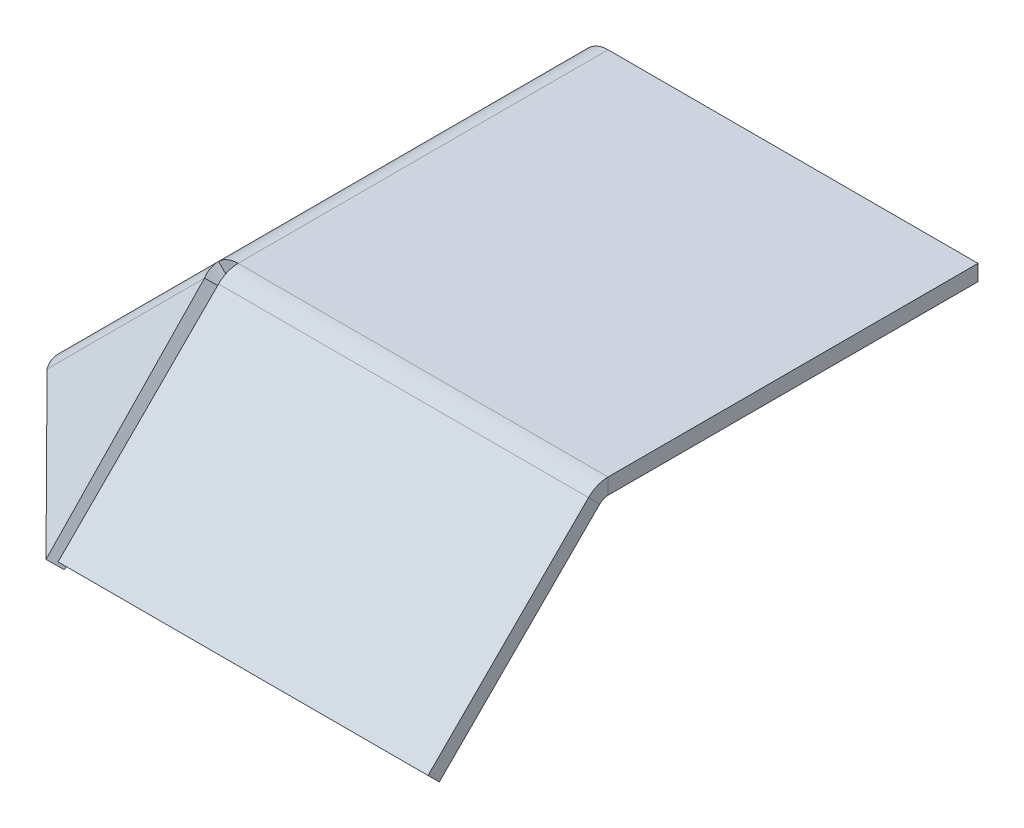
ISO-10303-21;
HEADER;
FILE_DESCRIPTION(('STEP AP214'),'2;1');
FILE_NAME('part.step','',(''),(''),'','','');
FILE_SCHEMA(('AUTOMOTIVE_DESIGN { 1 0 10303 214 1 1 1 1 }'));
ENDSEC;
DATA;
#1=APPLICATION_CONTEXT('core data for automotive mechanical design processes');
#2=APPLICATION_PROTOCOL_DEFINITION('international standard','automotive_design',2000,#1);
#3=PRODUCT_CONTEXT('',#1,'mechanical');
#4=PRODUCT('Part','Part','',(#3));
#5=PRODUCT_RELATED_PRODUCT_CATEGORY('part','',(#4));
#6=PRODUCT_DEFINITION_FORMATION('','',#4);
#7=PRODUCT_DEFINITION_CONTEXT('part definition',#1,'design');
#8=PRODUCT_DEFINITION('design','',#6,#7);
#9=PRODUCT_DEFINITION_SHAPE('','',#8);
#10=(LENGTH_UNIT() NAMED_UNIT(*) SI_UNIT(.MILLI.,.METRE.));
#11=(NAMED_UNIT(*) PLANE_ANGLE_UNIT() SI_UNIT($,.RADIAN.));
#12=(NAMED_UNIT(*) SI_UNIT($,.STERADIAN.) SOLID_ANGLE_UNIT());
#13=UNCERTAINTY_MEASURE_WITH_UNIT(LENGTH_MEASURE(1.E-05),#10,'distance_accuracy_value','');
#14=(GEOMETRIC_REPRESENTATION_CONTEXT(3) GLOBAL_UNCERTAINTY_ASSIGNED_CONTEXT((#13)) GLOBAL_UNIT_ASSIGNED_CONTEXT((#10,
#11,#12)) REPRESENTATION_CONTEXT('',''));
#15=CARTESIAN_POINT('',(0.,0.,0.));
#16=DIRECTION('',(0.,0.,1.));
#17=DIRECTION('',(1.,0.,0.));
#18=AXIS2_PLACEMENT_3D('',#15,#16,#17);
#19=CARTESIAN_POINT('',(0.,-1.,0.));
#20=DIRECTION('',(0.,1.,0.));
#21=DIRECTION('',(0.,0.,1.));
#22=AXIS2_PLACEMENT_3D('',#19,#20,#21);
#23=PLANE('',#22);
#24=DIRECTION('',(-1.,0.,0.));
#25=VECTOR('',#24,1.);
#26=CARTESIAN_POINT('',(-10.7806767275829,-0.999999999999998,10.7806767275829));
#27=LINE('',#26,#25);
#28=CARTESIAN_POINT('',(-10.7806767275829,-0.999999999999998,10.7806767275829));
#29=VERTEX_POINT('',#28);
#30=CARTESIAN_POINT('',(12.5,-0.999999999999998,10.7806767275829));
#31=VERTEX_POINT('',#30);
#32=EDGE_CURVE('E398',#29,#31,#27,.F.);
#33=ORIENTED_EDGE('',*,*,#32,.F.);
#34=DIRECTION('',(0.,0.,-1.));
#35=VECTOR('',#34,1.);
#36=CARTESIAN_POINT('',(-10.7806767275829,-0.999999999999989,-12.5));
#37=LINE('',#36,#35);
#38=CARTESIAN_POINT('',(-10.7806767275829,-0.999999999999989,-12.5));
#39=VERTEX_POINT('',#38);
#40=EDGE_CURVE('E400',#39,#29,#37,.F.);
#41=ORIENTED_EDGE('',*,*,#40,.F.);
#42=DIRECTION('',(-1.,0.,0.));
#43=VECTOR('',#42,1.);
#44=CARTESIAN_POINT('',(-12.5,-1.,-12.5));
#45=LINE('',#44,#43);
#46=CARTESIAN_POINT('',(12.5,-1.,-12.5));
#47=VERTEX_POINT('',#46);
#48=EDGE_CURVE('E101',#47,#39,#45,.T.);
#49=ORIENTED_EDGE('',*,*,#48,.F.);
#50=DIRECTION('',(0.,0.,-1.));
#51=VECTOR('',#50,1.);
#52=CARTESIAN_POINT('',(12.5,-1.,-12.5));
#53=LINE('',#52,#51);
#54=EDGE_CURVE('E106',#31,#47,#53,.T.);
#55=ORIENTED_EDGE('',*,*,#54,.F.);
#56=EDGE_LOOP('',(#33,#41,#49,#55));
#57=FACE_BOUND('',#56,.T.);
#58=ADVANCED_FACE('F92',(#57),#23,.F.);
#59=CARTESIAN_POINT('',(0.,0.,0.));
#60=DIRECTION('',(0.,1.,0.));
#61=DIRECTION('',(0.,0.,1.));
#62=AXIS2_PLACEMENT_3D('',#59,#60,#61);
#63=PLANE('',#62);
#64=DIRECTION('',(0.,0.,-1.));
#65=VECTOR('',#64,1.);
#66=CARTESIAN_POINT('',(-10.7806767275829,0.,-12.5));
#67=LINE('',#66,#65);
#68=CARTESIAN_POINT('',(-10.7806767275829,0.,-12.5));
#69=VERTEX_POINT('',#68);
#70=CARTESIAN_POINT('',(-10.7806767275829,0.,10.7806767275829));
#71=VERTEX_POINT('',#70);
#72=EDGE_CURVE('E387',#69,#71,#67,.F.);
#73=ORIENTED_EDGE('',*,*,#72,.T.);
#74=DIRECTION('',(-1.,0.,0.));
#75=VECTOR('',#74,1.);
#76=CARTESIAN_POINT('',(-10.7806767275829,0.,10.7806767275829));
#77=LINE('',#76,#75);
#78=CARTESIAN_POINT('',(12.5,0.,10.7806767275829));
#79=VERTEX_POINT('',#78);
#80=EDGE_CURVE('E389',#71,#79,#77,.F.);
#81=ORIENTED_EDGE('',*,*,#80,.T.);
#82=DIRECTION('',(0.,0.,-1.));
#83=VECTOR('',#82,1.);
#84=CARTESIAN_POINT('',(12.5,0.,-12.5));
#85=LINE('',#84,#83);
#86=CARTESIAN_POINT('',(12.5,0.,-12.5));
#87=VERTEX_POINT('',#86);
#88=EDGE_CURVE('E383',#79,#87,#85,.T.);
#89=ORIENTED_EDGE('',*,*,#88,.T.);
#90=DIRECTION('',(-1.,0.,0.));
#91=VECTOR('',#90,1.);
#92=CARTESIAN_POINT('',(-12.5,0.,-12.5));
#93=LINE('',#92,#91);
#94=EDGE_CURVE('E379',#87,#69,#93,.T.);
#95=ORIENTED_EDGE('',*,*,#94,.T.);
#96=EDGE_LOOP('',(#73,#81,#89,#95));
#97=FACE_BOUND('',#96,.T.);
#98=ADVANCED_FACE('F361',(#97),#63,.T.);
#99=CARTESIAN_POINT('',(-12.5,-1.,-12.5));
#100=DIRECTION('',(0.,0.,-1.));
#101=DIRECTION('',(-1.,0.,0.));
#102=AXIS2_PLACEMENT_3D('',#99,#100,#101);
#103=PLANE('',#102);
#104=ORIENTED_EDGE('',*,*,#48,.T.);
#105=DIRECTION('',(0.,1.,0.));
#106=VECTOR('',#105,1.);
#107=CARTESIAN_POINT('',(-10.7806767275829,-0.999999999999989,-12.5));
#108=LINE('',#107,#106);
#109=EDGE_CURVE('E375',#39,#69,#108,.T.);
#110=ORIENTED_EDGE('',*,*,#109,.T.);
#111=ORIENTED_EDGE('',*,*,#94,.F.);
#112=DIRECTION('',(0.,1.,0.));
#113=VECTOR('',#112,1.);
#114=CARTESIAN_POINT('',(12.5,-1.,-12.5));
#115=LINE('',#114,#113);
#116=EDGE_CURVE('E13',#47,#87,#115,.T.);
#117=ORIENTED_EDGE('',*,*,#116,.F.);
#118=EDGE_LOOP('',(#104,#110,#111,#117));
#119=FACE_BOUND('',#118,.T.);
#120=ADVANCED_FACE('F364',(#119),#103,.T.);
#121=CARTESIAN_POINT('',(12.5,-1.,-12.5));
#122=DIRECTION('',(1.,0.,0.));
#123=DIRECTION('',(0.,0.,-1.));
#124=AXIS2_PLACEMENT_3D('',#121,#122,#123);
#125=PLANE('',#124);
#126=DIRECTION('',(0.,1.,0.));
#127=VECTOR('',#126,1.);
#128=CARTESIAN_POINT('',(12.5,-0.999999999999998,10.7806767275829));
#129=LINE('',#128,#127);
#130=EDGE_CURVE('E391',#31,#79,#129,.T.);
#131=ORIENTED_EDGE('',*,*,#130,.F.);
#132=ORIENTED_EDGE('',*,*,#54,.T.);
#133=ORIENTED_EDGE('',*,*,#116,.T.);
#134=ORIENTED_EDGE('',*,*,#88,.F.);
#135=EDGE_LOOP('',(#131,#132,#133,#134));
#136=FACE_BOUND('',#135,.T.);
#137=ADVANCED_FACE('F94',(#136),#125,.T.);
#138=CARTESIAN_POINT('',(-10.7806767275829,-1.7366,10.7806767275829));
#139=DIRECTION('',(0.,0.,1.));
#140=DIRECTION('',(0.,-1.,0.));
#141=AXIS2_PLACEMENT_3D('',#138,#139,#140);
#142=PLANE('',#141);
#143=DIRECTION('',(0.707106781186544,-0.707106781186551,0.));
#144=VECTOR('',#143,1.);
#145=CARTESIAN_POINT('',(-11.3015315826049,-1.21574514497799,10.7806767275829));
#146=LINE('',#145,#144);
#147=CARTESIAN_POINT('',(-12.0086383637914,-0.508638363791433,10.7806767275829));
#148=VERTEX_POINT('',#147);
#149=CARTESIAN_POINT('',(-11.3015315826049,-1.21574514497799,10.7806767275829));
#150=VERTEX_POINT('',#149);
#151=EDGE_CURVE('E411',#148,#150,#146,.T.);
#152=ORIENTED_EDGE('',*,*,#151,.T.);
#153=CARTESIAN_POINT('',(-10.7806767275829,-1.7366,10.7806767275829));
#154=DIRECTION('',(0.,0.,-1.));
#155=DIRECTION('',(0.,1.,0.));
#156=AXIS2_PLACEMENT_3D('',#153,#154,#155);
#157=CIRCLE('',#156,0.736600000000002);
#158=EDGE_CURVE('E448',#29,#150,#157,.F.);
#159=ORIENTED_EDGE('',*,*,#158,.F.);
#160=DIRECTION('',(0.,1.,0.));
#161=VECTOR('',#160,1.);
#162=CARTESIAN_POINT('',(-10.7806767275829,-0.999999999999998,10.7806767275829));
#163=LINE('',#162,#161);
#164=EDGE_CURVE('E384',#29,#71,#163,.T.);
#165=ORIENTED_EDGE('',*,*,#164,.T.);
#166=CARTESIAN_POINT('',(-10.7806767275829,-1.7366,10.7806767275829));
#167=DIRECTION('',(0.,0.,-1.));
#168=DIRECTION('',(0.,1.,0.));
#169=AXIS2_PLACEMENT_3D('',#166,#167,#168);
#170=CIRCLE('',#169,1.7366);
#171=EDGE_CURVE('E442',#71,#148,#170,.F.);
#172=ORIENTED_EDGE('',*,*,#171,.T.);
#173=EDGE_LOOP('',(#152,#159,#165,#172));
#174=FACE_BOUND('',#173,.T.);
#175=ADVANCED_FACE('F352',(#174),#142,.T.);
#176=CARTESIAN_POINT('',(-10.7806767275829,-1.73659999999999,-12.5));
#177=DIRECTION('',(0.,0.,1.));
#178=DIRECTION('',(0.,-1.,0.));
#179=AXIS2_PLACEMENT_3D('',#176,#177,#178);
#180=PLANE('',#179);
#181=CARTESIAN_POINT('',(-10.7806767275829,-1.73659999999999,-12.5));
#182=DIRECTION('',(0.,0.,-1.));
#183=DIRECTION('',(0.,1.,0.));
#184=AXIS2_PLACEMENT_3D('',#181,#182,#183);
#185=CIRCLE('',#184,0.736600000000002);
#186=CARTESIAN_POINT('',(-11.3015315826049,-1.21574514497798,-12.5));
#187=VERTEX_POINT('',#186);
#188=EDGE_CURVE('E414',#187,#39,#185,.T.);
#189=ORIENTED_EDGE('',*,*,#188,.F.);
#190=DIRECTION('',(-0.707106781186544,0.707106781186551,0.));
#191=VECTOR('',#190,1.);
#192=CARTESIAN_POINT('',(-11.3015315826049,-1.21574514497798,-12.5));
#193=LINE('',#192,#191);
#194=CARTESIAN_POINT('',(-12.0086383637914,-0.508638363791431,-12.5));
#195=VERTEX_POINT('',#194);
#196=EDGE_CURVE('E431',#187,#195,#193,.T.);
#197=ORIENTED_EDGE('',*,*,#196,.T.);
#198=CARTESIAN_POINT('',(-10.7806767275829,-1.73659999999999,-12.5));
#199=DIRECTION('',(0.,0.,-1.));
#200=DIRECTION('',(0.,1.,0.));
#201=AXIS2_PLACEMENT_3D('',#198,#199,#200);
#202=CIRCLE('',#201,1.7366);
#203=EDGE_CURVE('E443',#195,#69,#202,.T.);
#204=ORIENTED_EDGE('',*,*,#203,.T.);
#205=ORIENTED_EDGE('',*,*,#109,.F.);
#206=EDGE_LOOP('',(#189,#197,#204,#205));
#207=FACE_BOUND('',#206,.T.);
#208=ADVANCED_FACE('F347',(#207),#180,.F.);
#209=CARTESIAN_POINT('',(-10.7806767275829,-1.73659999999999,-12.5));
#210=DIRECTION('',(0.,0.,-1.));
#211=DIRECTION('',(-0.707106781186544,0.707106781186551,0.));
#212=AXIS2_PLACEMENT_3D('',#209,#210,#211);
#213=CYLINDRICAL_SURFACE('',#212,1.7366);
#214=ORIENTED_EDGE('',*,*,#72,.F.);
#215=ORIENTED_EDGE('',*,*,#203,.F.);
#216=DIRECTION('',(0.,0.,-1.));
#217=VECTOR('',#216,1.);
#218=CARTESIAN_POINT('',(-12.0086383637914,-0.508638363791432,0.));
#219=LINE('',#218,#217);
#220=EDGE_CURVE('E428',#148,#195,#219,.T.);
#221=ORIENTED_EDGE('',*,*,#220,.F.);
#222=ORIENTED_EDGE('',*,*,#171,.F.);
#223=EDGE_LOOP('',(#214,#215,#221,#222));
#224=FACE_BOUND('',#223,.T.);
#225=ADVANCED_FACE('F344',(#224),#213,.T.);
#226=CARTESIAN_POINT('',(-10.7806767275829,-1.73659999999999,-12.5));
#227=DIRECTION('',(0.,0.,-1.));
#228=DIRECTION('',(-0.707106781186544,0.707106781186551,0.));
#229=AXIS2_PLACEMENT_3D('',#226,#227,#228);
#230=CYLINDRICAL_SURFACE('',#229,0.736600000000002);
#231=ORIENTED_EDGE('',*,*,#40,.T.);
#232=ORIENTED_EDGE('',*,*,#158,.T.);
#233=DIRECTION('',(0.,0.,1.));
#234=VECTOR('',#233,1.);
#235=CARTESIAN_POINT('',(-11.3015315826049,-1.21574514497798,12.5));
#236=LINE('',#235,#234);
#237=EDGE_CURVE('E434',#150,#187,#236,.F.);
#238=ORIENTED_EDGE('',*,*,#237,.T.);
#239=ORIENTED_EDGE('',*,*,#188,.T.);
#240=EDGE_LOOP('',(#231,#232,#238,#239));
#241=FACE_BOUND('',#240,.T.);
#242=ADVANCED_FACE('F332',(#241),#230,.F.);
#243=CARTESIAN_POINT('',(-5.04289321881338,6.45710678118655,0.));
#244=DIRECTION('',(-0.707106781186544,0.707106781186551,0.));
#245=DIRECTION('',(-0.707106781186551,-0.707106781186544,0.));
#246=AXIS2_PLACEMENT_3D('',#243,#244,#245);
#247=PLANE('',#246);
#248=DIRECTION('',(0.,0.,-1.));
#249=VECTOR('',#248,1.);
#250=CARTESIAN_POINT('',(-22.1066017177983,-10.6066017177982,-12.5));
#251=LINE('',#250,#249);
#252=CARTESIAN_POINT('',(-22.1066017177982,-10.6066017177982,10.7806767275829));
#253=VERTEX_POINT('',#252);
#254=CARTESIAN_POINT('',(-22.1066017177983,-10.6066017177982,-12.5));
#255=VERTEX_POINT('',#254);
#256=EDGE_CURVE('E421',#253,#255,#251,.T.);
#257=ORIENTED_EDGE('',*,*,#256,.F.);
#258=DIRECTION('',(0.707106781186551,0.707106781186544,0.));
#259=VECTOR('',#258,1.);
#260=CARTESIAN_POINT('',(-5.04289321881338,6.45710678118654,10.7806767275829));
#261=LINE('',#260,#259);
#262=EDGE_CURVE('E202',#253,#148,#261,.T.);
#263=ORIENTED_EDGE('',*,*,#262,.T.);
#264=ORIENTED_EDGE('',*,*,#220,.T.);
#265=DIRECTION('',(0.707106781186551,0.707106781186544,0.));
#266=VECTOR('',#265,1.);
#267=CARTESIAN_POINT('',(-11.7928932188134,-0.292893218813447,-12.5));
#268=LINE('',#267,#266);
#269=EDGE_CURVE('E418',#255,#195,#268,.T.);
#270=ORIENTED_EDGE('',*,*,#269,.F.);
#271=EDGE_LOOP('',(#257,#263,#264,#270));
#272=FACE_BOUND('',#271,.T.);
#273=ADVANCED_FACE('F328',(#272),#247,.T.);
#274=CARTESIAN_POINT('',(-4.33578643762683,5.74999999999999,0.));
#275=DIRECTION('',(-0.707106781186544,0.707106781186551,0.));
#276=DIRECTION('',(-0.707106781186551,-0.707106781186544,0.));
#277=AXIS2_PLACEMENT_3D('',#274,#275,#276);
#278=PLANE('',#277);
#279=DIRECTION('',(0.707106781186551,0.707106781186544,0.));
#280=VECTOR('',#279,1.);
#281=CARTESIAN_POINT('',(-4.33578643762683,5.74999999999999,10.7806767275829));
#282=LINE('',#281,#280);
#283=CARTESIAN_POINT('',(-21.3994949366117,-11.3137084989848,10.7806767275829));
#284=VERTEX_POINT('',#283);
#285=EDGE_CURVE('E394',#150,#284,#282,.F.);
#286=ORIENTED_EDGE('',*,*,#285,.T.);
#287=DIRECTION('',(0.,0.,1.));
#288=VECTOR('',#287,1.);
#289=CARTESIAN_POINT('',(-21.3994949366117,-11.3137084989847,0.));
#290=LINE('',#289,#288);
#291=CARTESIAN_POINT('',(-21.3994949366117,-11.3137084989847,-12.5));
#292=VERTEX_POINT('',#291);
#293=EDGE_CURVE('E426',#284,#292,#290,.F.);
#294=ORIENTED_EDGE('',*,*,#293,.T.);
#295=DIRECTION('',(-0.707106781186551,-0.707106781186544,0.));
#296=VECTOR('',#295,1.);
#297=CARTESIAN_POINT('',(-4.33578643762683,5.74999999999999,-12.5));
#298=LINE('',#297,#296);
#299=EDGE_CURVE('E423',#292,#187,#298,.F.);
#300=ORIENTED_EDGE('',*,*,#299,.T.);
#301=ORIENTED_EDGE('',*,*,#237,.F.);
#302=EDGE_LOOP('',(#286,#294,#300,#301));
#303=FACE_BOUND('',#302,.T.);
#304=ADVANCED_FACE('F331',(#303),#278,.F.);
#305=CARTESIAN_POINT('',(-22.1066017177983,-10.6066017177982,-12.5));
#306=DIRECTION('',(-0.707106781186551,-0.707106781186544,0.));
#307=DIRECTION('',(0.707106781186544,-0.707106781186551,0.));
#308=AXIS2_PLACEMENT_3D('',#305,#306,#307);
#309=PLANE('',#308);
#310=ORIENTED_EDGE('',*,*,#293,.F.);
#311=DIRECTION('',(-0.707106781186544,0.707106781186551,0.));
#312=VECTOR('',#311,1.);
#313=CARTESIAN_POINT('',(-22.1066017177983,-10.6066017177982,10.7806767275829));
#314=LINE('',#313,#312);
#315=EDGE_CURVE('E436',#284,#253,#314,.T.);
#316=ORIENTED_EDGE('',*,*,#315,.T.);
#317=ORIENTED_EDGE('',*,*,#256,.T.);
#318=DIRECTION('',(0.707106781186544,-0.707106781186551,0.));
#319=VECTOR('',#318,1.);
#320=CARTESIAN_POINT('',(-22.1066017177983,-10.6066017177982,-12.5));
#321=LINE('',#320,#319);
#322=EDGE_CURVE('E415',#255,#292,#321,.T.);
#323=ORIENTED_EDGE('',*,*,#322,.T.);
#324=EDGE_LOOP('',(#310,#316,#317,#323));
#325=FACE_BOUND('',#324,.T.);
#326=ADVANCED_FACE('F336',(#325),#309,.T.);
#327=CARTESIAN_POINT('',(-11.7928932188134,-0.292893218813448,-12.5));
#328=DIRECTION('',(0.,0.,-1.));
#329=DIRECTION('',(-1.,0.,0.));
#330=AXIS2_PLACEMENT_3D('',#327,#328,#329);
#331=PLANE('',#330);
#332=ORIENTED_EDGE('',*,*,#269,.T.);
#333=ORIENTED_EDGE('',*,*,#196,.F.);
#334=ORIENTED_EDGE('',*,*,#299,.F.);
#335=ORIENTED_EDGE('',*,*,#322,.F.);
#336=EDGE_LOOP('',(#332,#333,#334,#335));
#337=FACE_BOUND('',#336,.T.);
#338=ADVANCED_FACE('F323',(#337),#331,.T.);
#339=CARTESIAN_POINT('',(12.5,-1.7366,10.7806767275829));
#340=DIRECTION('',(1.,0.,0.));
#341=DIRECTION('',(0.,0.,-1.));
#342=AXIS2_PLACEMENT_3D('',#339,#340,#341);
#343=PLANE('',#342);
#344=DIRECTION('',(0.,0.707106781186551,0.707106781186544));
#345=VECTOR('',#344,1.);
#346=CARTESIAN_POINT('',(12.5,-0.508638363791435,12.0086383637914));
#347=LINE('',#346,#345);
#348=CARTESIAN_POINT('',(12.5,-1.21574514497799,11.3015315826049));
#349=VERTEX_POINT('',#348);
#350=CARTESIAN_POINT('',(12.5,-0.508638363791434,12.0086383637914));
#351=VERTEX_POINT('',#350);
#352=EDGE_CURVE('E720',#349,#351,#347,.T.);
#353=ORIENTED_EDGE('',*,*,#352,.F.);
#354=CARTESIAN_POINT('',(12.5,-1.7366,10.7806767275829));
#355=DIRECTION('',(-1.,0.,0.));
#356=DIRECTION('',(0.,0.,1.));
#357=AXIS2_PLACEMENT_3D('',#354,#355,#356);
#358=CIRCLE('',#357,0.736600000000001);
#359=EDGE_CURVE('E403',#31,#349,#358,.F.);
#360=ORIENTED_EDGE('',*,*,#359,.F.);
#361=ORIENTED_EDGE('',*,*,#130,.T.);
#362=CARTESIAN_POINT('',(12.5,-1.7366,10.7806767275829));
#363=DIRECTION('',(-1.,0.,0.));
#364=DIRECTION('',(0.,0.,1.));
#365=AXIS2_PLACEMENT_3D('',#362,#363,#364);
#366=CIRCLE('',#365,1.7366);
#367=EDGE_CURVE('E395',#79,#351,#366,.F.);
#368=ORIENTED_EDGE('',*,*,#367,.T.);
#369=EDGE_LOOP('',(#353,#360,#361,#368));
#370=FACE_BOUND('',#369,.T.);
#371=ADVANCED_FACE('F320',(#370),#343,.T.);
#372=CARTESIAN_POINT('',(-10.7806767275829,-1.7366,10.7806767275829));
#373=DIRECTION('',(1.,0.,0.));
#374=DIRECTION('',(0.,0.,-1.));
#375=AXIS2_PLACEMENT_3D('',#372,#373,#374);
#376=PLANE('',#375);
#377=CARTESIAN_POINT('',(-10.7806767275829,-1.7366,10.7806767275829));
#378=DIRECTION('',(-1.,0.,0.));
#379=DIRECTION('',(0.,0.,1.));
#380=AXIS2_PLACEMENT_3D('',#377,#378,#379);
#381=CIRCLE('',#380,0.736600000000001);
#382=CARTESIAN_POINT('',(-10.7806767275829,-1.21574514497799,11.3015315826049));
#383=VERTEX_POINT('',#382);
#384=EDGE_CURVE('E404',#383,#29,#381,.T.);
#385=ORIENTED_EDGE('',*,*,#384,.F.);
#386=DIRECTION('',(0.,0.707106781186551,0.707106781186544));
#387=VECTOR('',#386,1.);
#388=CARTESIAN_POINT('',(-10.7806767275829,-1.21574514497798,11.3015315826049));
#389=LINE('',#388,#387);
#390=CARTESIAN_POINT('',(-10.7806767275829,-0.508638363791434,12.0086383637914));
#391=VERTEX_POINT('',#390);
#392=EDGE_CURVE('E278',#391,#383,#389,.F.);
#393=ORIENTED_EDGE('',*,*,#392,.F.);
#394=CARTESIAN_POINT('',(-10.7806767275829,-1.7366,10.7806767275829));
#395=DIRECTION('',(-1.,0.,0.));
#396=DIRECTION('',(0.,0.,1.));
#397=AXIS2_PLACEMENT_3D('',#394,#395,#396);
#398=CIRCLE('',#397,1.7366);
#399=EDGE_CURVE('E406',#391,#71,#398,.T.);
#400=ORIENTED_EDGE('',*,*,#399,.T.);
#401=ORIENTED_EDGE('',*,*,#164,.F.);
#402=EDGE_LOOP('',(#385,#393,#400,#401));
#403=FACE_BOUND('',#402,.T.);
#404=ADVANCED_FACE('F315',(#403),#376,.F.);
#405=CARTESIAN_POINT('',(-10.7806767275829,-1.7366,10.7806767275829));
#406=DIRECTION('',(-1.,0.,0.));
#407=DIRECTION('',(0.,0.707106781186551,0.707106781186544));
#408=AXIS2_PLACEMENT_3D('',#405,#406,#407);
#409=CYLINDRICAL_SURFACE('',#408,1.7366);
#410=ORIENTED_EDGE('',*,*,#80,.F.);
#411=ORIENTED_EDGE('',*,*,#399,.F.);
#412=DIRECTION('',(-1.,0.,0.));
#413=VECTOR('',#412,1.);
#414=CARTESIAN_POINT('',(12.5,-0.508638363791436,12.0086383637914));
#415=LINE('',#414,#413);
#416=EDGE_CURVE('E719',#391,#351,#415,.F.);
#417=ORIENTED_EDGE('',*,*,#416,.T.);
#418=ORIENTED_EDGE('',*,*,#367,.F.);
#419=EDGE_LOOP('',(#410,#411,#417,#418));
#420=FACE_BOUND('',#419,.T.);
#421=ADVANCED_FACE('F312',(#420),#409,.T.);
#422=CARTESIAN_POINT('',(-10.7806767275829,-1.7366,10.7806767275829));
#423=DIRECTION('',(-1.,0.,0.));
#424=DIRECTION('',(0.,0.707106781186551,0.707106781186544));
#425=AXIS2_PLACEMENT_3D('',#422,#423,#424);
#426=CYLINDRICAL_SURFACE('',#425,0.736600000000001);
#427=ORIENTED_EDGE('',*,*,#32,.T.);
#428=ORIENTED_EDGE('',*,*,#359,.T.);
#429=DIRECTION('',(-1.,0.,0.));
#430=VECTOR('',#429,1.);
#431=CARTESIAN_POINT('',(12.5,-1.21574514497799,11.3015315826049));
#432=LINE('',#431,#430);
#433=EDGE_CURVE('E462',#349,#383,#432,.T.);
#434=ORIENTED_EDGE('',*,*,#433,.T.);
#435=ORIENTED_EDGE('',*,*,#384,.T.);
#436=EDGE_LOOP('',(#427,#428,#434,#435));
#437=FACE_BOUND('',#436,.T.);
#438=ADVANCED_FACE('F310',(#437),#426,.F.);
#439=CARTESIAN_POINT('',(12.5,-0.29289321881345,11.7928932188134));
#440=DIRECTION('',(1.,0.,0.));
#441=DIRECTION('',(0.,0.,-1.));
#442=AXIS2_PLACEMENT_3D('',#439,#440,#441);
#443=PLANE('',#442);
#444=DIRECTION('',(0.,-0.707106781186544,0.707106781186551));
#445=VECTOR('',#444,1.);
#446=CARTESIAN_POINT('',(12.5,5.74999999999999,4.33578643762683));
#447=LINE('',#446,#445);
#448=CARTESIAN_POINT('',(12.5,-11.3137084989847,21.3994949366117));
#449=VERTEX_POINT('',#448);
#450=EDGE_CURVE('E722',#349,#449,#447,.T.);
#451=ORIENTED_EDGE('',*,*,#450,.F.);
#452=ORIENTED_EDGE('',*,*,#352,.T.);
#453=DIRECTION('',(0.,0.707106781186544,-0.707106781186551));
#454=VECTOR('',#453,1.);
#455=CARTESIAN_POINT('',(12.5,-0.29289321881345,11.7928932188134));
#456=LINE('',#455,#454);
#457=CARTESIAN_POINT('',(12.5,-10.6066017177982,22.1066017177983));
#458=VERTEX_POINT('',#457);
#459=EDGE_CURVE('E738',#351,#458,#456,.F.);
#460=ORIENTED_EDGE('',*,*,#459,.T.);
#461=DIRECTION('',(0.,-0.707106781186551,-0.707106781186544));
#462=VECTOR('',#461,1.);
#463=CARTESIAN_POINT('',(12.5,-10.6066017177982,22.1066017177983));
#464=LINE('',#463,#462);
#465=EDGE_CURVE('E747',#458,#449,#464,.T.);
#466=ORIENTED_EDGE('',*,*,#465,.T.);
#467=EDGE_LOOP('',(#451,#452,#460,#466));
#468=FACE_BOUND('',#467,.T.);
#469=ADVANCED_FACE('F300',(#468),#443,.T.);
#470=CARTESIAN_POINT('',(0.,6.45710678118655,5.04289321881337));
#471=DIRECTION('',(0.,-0.707106781186551,-0.707106781186544));
#472=DIRECTION('',(0.,0.707106781186544,-0.707106781186551));
#473=AXIS2_PLACEMENT_3D('',#470,#471,#472);
#474=PLANE('',#473);
#475=ORIENTED_EDGE('',*,*,#416,.F.);
#476=DIRECTION('',(0.,-0.707106781186544,0.707106781186551));
#477=VECTOR('',#476,1.);
#478=CARTESIAN_POINT('',(-10.7806767275829,6.45710678118655,5.04289321881337));
#479=LINE('',#478,#477);
#480=CARTESIAN_POINT('',(-10.7806767275829,-10.6066017177982,22.1066017177983));
#481=VERTEX_POINT('',#480);
#482=EDGE_CURVE('E731',#391,#481,#479,.T.);
#483=ORIENTED_EDGE('',*,*,#482,.T.);
#484=DIRECTION('',(1.,0.,0.));
#485=VECTOR('',#484,1.);
#486=CARTESIAN_POINT('',(12.5,-10.6066017177982,22.1066017177983));
#487=LINE('',#486,#485);
#488=EDGE_CURVE('E744',#458,#481,#487,.F.);
#489=ORIENTED_EDGE('',*,*,#488,.F.);
#490=ORIENTED_EDGE('',*,*,#459,.F.);
#491=EDGE_LOOP('',(#475,#483,#489,#490));
#492=FACE_BOUND('',#491,.T.);
#493=ADVANCED_FACE('F296',(#492),#474,.F.);
#494=CARTESIAN_POINT('',(0.,5.74999999999999,4.33578643762683));
#495=DIRECTION('',(0.,-0.707106781186551,-0.707106781186544));
#496=DIRECTION('',(0.,0.707106781186544,-0.707106781186551));
#497=AXIS2_PLACEMENT_3D('',#494,#495,#496);
#498=PLANE('',#497);
#499=DIRECTION('',(0.,0.707106781186544,-0.707106781186551));
#500=VECTOR('',#499,1.);
#501=CARTESIAN_POINT('',(-10.7806767275829,-1.,11.0857864376269));
#502=LINE('',#501,#500);
#503=CARTESIAN_POINT('',(-10.7806767275829,-11.3137084989847,21.3994949366117));
#504=VERTEX_POINT('',#503);
#505=EDGE_CURVE('E248',#383,#504,#502,.F.);
#506=ORIENTED_EDGE('',*,*,#505,.F.);
#507=ORIENTED_EDGE('',*,*,#433,.F.);
#508=ORIENTED_EDGE('',*,*,#450,.T.);
#509=DIRECTION('',(-1.,0.,0.));
#510=VECTOR('',#509,1.);
#511=CARTESIAN_POINT('',(0.,-11.3137084989847,21.3994949366117));
#512=LINE('',#511,#510);
#513=EDGE_CURVE('E745',#449,#504,#512,.T.);
#514=ORIENTED_EDGE('',*,*,#513,.T.);
#515=EDGE_LOOP('',(#506,#507,#508,#514));
#516=FACE_BOUND('',#515,.T.);
#517=ADVANCED_FACE('F299',(#516),#498,.T.);
#518=CARTESIAN_POINT('',(12.5,-10.6066017177982,22.1066017177983));
#519=DIRECTION('',(0.,-0.707106781186544,0.707106781186551));
#520=DIRECTION('',(0.,-0.707106781186551,-0.707106781186544));
#521=AXIS2_PLACEMENT_3D('',#518,#519,#520);
#522=PLANE('',#521);
#523=DIRECTION('',(0.,-0.707106781186551,-0.707106781186544));
#524=VECTOR('',#523,1.);
#525=CARTESIAN_POINT('',(-10.7806767275829,-11.3137084989847,21.3994949366117));
#526=LINE('',#525,#524);
#527=EDGE_CURVE('E725',#504,#481,#526,.F.);
#528=ORIENTED_EDGE('',*,*,#527,.F.);
#529=ORIENTED_EDGE('',*,*,#513,.F.);
#530=ORIENTED_EDGE('',*,*,#465,.F.);
#531=ORIENTED_EDGE('',*,*,#488,.T.);
#532=EDGE_LOOP('',(#528,#529,#530,#531));
#533=FACE_BOUND('',#532,.T.);
#534=ADVANCED_FACE('F294',(#533),#522,.T.);
#535=CARTESIAN_POINT('',(-10.7806767275829,-1.,11.0857864376269));
#536=DIRECTION('',(1.,0.,0.));
#537=DIRECTION('',(0.,0.,-1.));
#538=AXIS2_PLACEMENT_3D('',#535,#536,#537);
#539=PLANE('',#538);
#540=ORIENTED_EDGE('',*,*,#505,.T.);
#541=ORIENTED_EDGE('',*,*,#527,.T.);
#542=ORIENTED_EDGE('',*,*,#482,.F.);
#543=ORIENTED_EDGE('',*,*,#392,.T.);
#544=EDGE_LOOP('',(#540,#541,#542,#543));
#545=FACE_BOUND('',#544,.T.);
#546=ADVANCED_FACE('F285',(#545),#539,.F.);
#547=CARTESIAN_POINT('',(-12.0157094316033,-0.50156729597958,10.7806767275828));
#548=CARTESIAN_POINT('',(-12.0483774014007,-0.534235265776928,11.1475594195412));
#549=CARTESIAN_POINT('',(-11.9973740380784,-0.649999758608421,11.5104881165006));
#550=CARTESIAN_POINT('',(-11.8775556780936,-0.835154058187977,11.8073024492369));
#551=CARTESIAN_POINT('',(-12.0086383637914,-0.508638363791445,10.7806767275828));
#552=CARTESIAN_POINT('',(-12.0413062915467,-0.541306291546747,11.1454586679545));
#553=CARTESIAN_POINT('',(-11.9907803371433,-0.656593543627676,11.5063098077123));
#554=CARTESIAN_POINT('',(-11.8718350640654,-0.840874672216154,11.801424596714));
#555=CARTESIAN_POINT('',(-11.3015315826049,-1.21574514497799,10.7806767275829));
#556=CARTESIAN_POINT('',(-11.3341953061556,-1.24840886852872,10.9353835092792));
#557=CARTESIAN_POINT('',(-11.3314102436269,-1.31597204555326,11.0884789288841));
#558=CARTESIAN_POINT('',(-11.2997736612477,-1.41293607503384,11.2136393444215));
#559=B_SPLINE_SURFACE_WITH_KNOTS('',1,3,((#547,#548,#549,#550),(#551,#552,#553,#554),(#555,#556,
#557,#558)),.UNSPECIFIED.,.F.,.F.,.F.,(2,1,2),(4,4),(-0.01,0.,1.),(0.,1.),.UNSPECIFIED.);
#560=DIRECTION('',(-0.572061402817684,0.572061402817689,0.587785252292469));
#561=VECTOR('',#560,1.);
#562=CARTESIAN_POINT('',(-11.8718350640654,-0.840874672216149,11.801424596714));
#563=LINE('',#562,#561);
#564=CARTESIAN_POINT('',(-11.2997736612477,-1.41293607503384,11.2136393444215));
#565=VERTEX_POINT('',#564);
#566=CARTESIAN_POINT('',(-11.8718350640654,-0.840874672216152,11.801424596714));
#567=VERTEX_POINT('',#566);
#568=EDGE_CURVE('E240',#565,#567,#563,.T.);
#569=CARTESIAN_POINT('',(-11.3015315826049,-1.21574514497799,10.7806767275829));
#570=CARTESIAN_POINT('',(-11.3078074044639,-1.2220061263786,10.8103616439441));
#571=CARTESIAN_POINT('',(-11.3128010685234,-1.2295515047085,10.840049912365));
#572=CARTESIAN_POINT('',(-11.3202670716718,-1.24714921279859,10.8989654168369));
#573=CARTESIAN_POINT('',(-11.3227418860239,-1.25719906930178,10.9281930776559));
#574=CARTESIAN_POINT('',(-11.3249603029804,-1.27734906695341,10.9796340206465));
#575=CARTESIAN_POINT('',(-11.3251741160527,-1.28698062516489,11.0020129221652));
#576=CARTESIAN_POINT('',(-11.3241231895302,-1.30772222718384,11.0460366811713));
#577=CARTESIAN_POINT('',(-11.3228586672997,-1.31883205342407,11.0676816460903));
#578=CARTESIAN_POINT('',(-11.3188376403783,-1.34289153248263,11.1107851012641));
#579=CARTESIAN_POINT('',(-11.3160304454967,-1.35589198471001,11.1322105257592));
#580=CARTESIAN_POINT('',(-11.3089686043548,-1.38334538218363,11.173871451153));
#581=CARTESIAN_POINT('',(-11.3047133554868,-1.39779893036845,11.1941064525388));
#582=CARTESIAN_POINT('',(-11.2997736612477,-1.41293607503384,11.2136393444215));
#583=B_SPLINE_CURVE_WITH_KNOTS('',3,(#569,#570,#571,#572,#573,#574,#575,#576,#577,#578,#579,
#580,#581,#582),.UNSPECIFIED.,.F.,.F.,(4,2,2,2,2,2,4),(0.,0.0928968891807609,0.18570240057377,
0.258699235234206,0.331685338288477,0.407226986942114,0.482800110768843),.UNSPECIFIED.);
#584=EDGE_CURVE('E206',#150,#565,#583,.T.);
#585=CARTESIAN_POINT('',(-12.0086383637914,-0.508638363791454,10.780676727583));
#586=CARTESIAN_POINT('',(-12.0124811463772,-0.512483210547689,10.8235957211909));
#587=CARTESIAN_POINT('',(-12.0151987217418,-0.517450478925515,10.8664938923262));
#588=CARTESIAN_POINT('',(-12.0183928818492,-0.529628168984556,10.952066374094));
#589=CARTESIAN_POINT('',(-12.0188688624693,-0.536839194813118,10.9947406212828));
#590=CARTESIAN_POINT('',(-12.0169508944522,-0.561772428150175,11.1218189079632));
#591=CARTESIAN_POINT('',(-12.0112380454676,-0.582822093453643,11.2055848852899));
#592=CARTESIAN_POINT('',(-11.9957080026662,-0.622168439596653,11.3328006590977));
#593=CARTESIAN_POINT('',(-11.988853365863,-0.63751342353646,11.3775853607409));
#594=CARTESIAN_POINT('',(-11.9725928640308,-0.670755527622008,11.4657185566022));
#595=CARTESIAN_POINT('',(-11.9631878393239,-0.688651806227463,11.5090675186094));
#596=CARTESIAN_POINT('',(-11.941622449099,-0.727436042447079,11.5952105161846));
#597=CARTESIAN_POINT('',(-11.9293931828713,-0.748392953570438,11.6379561909744));
#598=CARTESIAN_POINT('',(-11.9024486710843,-0.79279735203485,11.7213469667963));
#599=CARTESIAN_POINT('',(-11.8877321837768,-0.816246081237693,11.7619910052818));
#600=CARTESIAN_POINT('',(-11.8718350640654,-0.840874672216154,11.801424596714));
#601=B_SPLINE_CURVE_WITH_KNOTS('',3,(#585,#586,#587,#588,#589,#590,#591,#592,#593,#594,#595,
#596,#597,#598,#599,#600),.UNSPECIFIED.,.F.,.F.,(4,2,2,2,2,2,2,4),(0.,0.129714716838913,
0.259464390537957,0.518045980728776,0.661422699762717,0.804752235180634,0.952038798709532,
1.0993991136415),.UNSPECIFIED.);
#602=EDGE_CURVE('E205',#148,#567,#601,.T.);
#603=ORIENTED_EDGE('',*,*,#568,.F.);
#604=ORIENTED_EDGE('',*,*,#584,.F.);
#605=ORIENTED_EDGE('',*,*,#151,.F.);
#606=ORIENTED_EDGE('',*,*,#602,.T.);
#607=EDGE_LOOP('',(#603,#604,#605,#606));
#608=FACE_BOUND('',#607,.T.);
#609=ADVANCED_FACE('F254',(#608),#559,.F.);
#610=CARTESIAN_POINT('',(-21.784934579969,-10.7425329600634,11.8073024492369));
#611=CARTESIAN_POINT('',(-21.9684684542999,-10.6210933175282,11.5104872821325));
#612=CARTESIAN_POINT('',(-22.0826256697122,-10.5684835340885,11.1475604508768));
#613=CARTESIAN_POINT('',(-22.1136727856101,-10.5995306499864,10.7806767275829));
#614=CARTESIAN_POINT('',(-21.7792139659408,-10.7482535740916,11.8014245967139));
#615=CARTESIAN_POINT('',(-21.9618746800594,-10.6276870191436,11.5063089635159));
#616=CARTESIAN_POINT('',(-22.0755546382129,-10.5755546382129,11.1454597114386));
#617=CARTESIAN_POINT('',(-22.1066017177982,-10.6066017177982,10.7806767275829));
#618=CARTESIAN_POINT('',(-21.2071525631231,-11.3203149769092,11.2136393444215));
#619=CARTESIAN_POINT('',(-21.3024972560074,-11.2870571806794,11.0884771018481));
#620=CARTESIAN_POINT('',(-21.3684514882844,-11.2826650506575,10.9353857676199));
#621=CARTESIAN_POINT('',(-21.3994949366117,-11.3137084989848,10.7806767275829));
#622=B_SPLINE_SURFACE_WITH_KNOTS('',1,3,((#610,#611,#612,#613),(#614,#615,#616,#617),(#618,#619,
#620,#621)),.UNSPECIFIED.,.F.,.F.,.F.,(2,1,2),(4,4),(-0.01,0.,1.),(0.,1.),.UNSPECIFIED.);
#623=CARTESIAN_POINT('',(-21.2071525631231,-11.3203149769092,11.2136393444215));
#624=CARTESIAN_POINT('',(-21.2255297560228,-11.3139019265726,11.1895304849445));
#625=CARTESIAN_POINT('',(-21.2428625673045,-11.3085354601592,11.1643430160098));
#626=CARTESIAN_POINT('',(-21.2752761187136,-11.3000404562121,11.1122392866571));
#627=CARTESIAN_POINT('',(-21.2903591297109,-11.2969096498217,11.0853248092191));
#628=CARTESIAN_POINT('',(-21.3151087434295,-11.2934428126145,11.0361793649988));
#629=CARTESIAN_POINT('',(-21.3252384738786,-11.2926452796869,11.0142115757244));
#630=CARTESIAN_POINT('',(-21.3440042384947,-11.2925438467487,10.9696458132508));
#631=CARTESIAN_POINT('',(-21.3526404998159,-11.2932397193774,10.947047936495));
#632=CARTESIAN_POINT('',(-21.3686608232221,-11.2962143444436,10.9006212579247));
#633=CARTESIAN_POINT('',(-21.3759902618824,-11.2985478244502,10.8767770974375));
#634=CARTESIAN_POINT('',(-21.3889923490444,-11.3048764038959,10.8288477856237));
#635=CARTESIAN_POINT('',(-21.3946642966198,-11.3088722045774,10.8047625367847));
#636=CARTESIAN_POINT('',(-21.3994949366117,-11.3137084989848,10.7806767275829));
#637=B_SPLINE_CURVE_WITH_KNOTS('',3,(#623,#624,#625,#626,#627,#628,#629,#630,#631,#632,#633,
#634,#635,#636),.UNSPECIFIED.,.F.,.F.,(4,2,2,2,2,2,4),(0.,0.0929111863398702,0.185727947353849,
0.258243716594907,0.330748446583349,0.40579931248463,0.480881870409133),.UNSPECIFIED.);
#638=CARTESIAN_POINT('',(-21.2071525631231,-11.3203149769092,11.2136393444215));
#639=VERTEX_POINT('',#638);
#640=EDGE_CURVE('E213',#639,#284,#637,.T.);
#641=DIRECTION('',(-0.572061402817684,0.572061402817689,0.587785252292469));
#642=VECTOR('',#641,1.);
#643=CARTESIAN_POINT('',(-21.2071525631232,-11.3203149769092,11.2136393444215));
#644=LINE('',#643,#642);
#645=CARTESIAN_POINT('',(-21.7792139659409,-10.7482535740915,11.801424596714));
#646=VERTEX_POINT('',#645);
#647=EDGE_CURVE('E210',#639,#646,#644,.T.);
#648=CARTESIAN_POINT('',(-21.7792139659408,-10.7482535740916,11.8014245967139));
#649=CARTESIAN_POINT('',(-21.8007220698359,-10.7340576225653,11.7666731588846));
#650=CARTESIAN_POINT('',(-21.8213094902621,-10.7207796925797,11.7310029390549));
#651=CARTESIAN_POINT('',(-21.8605752795014,-10.6961349493727,11.6579772513814));
#652=CARTESIAN_POINT('',(-21.8792531298374,-10.6847686546518,11.6206213297914));
#653=CARTESIAN_POINT('',(-21.9321783509722,-10.6537343854462,11.5065534358655));
#654=CARTESIAN_POINT('',(-21.9634712294007,-10.6370290750037,11.4275920341126));
#655=CARTESIAN_POINT('',(-22.0054543634935,-10.6176863503796,11.3018213701568));
#656=CARTESIAN_POINT('',(-22.0191060211678,-10.612097919082,11.2563931374401));
#657=CARTESIAN_POINT('',(-22.0437522278141,-10.6035790310788,11.1645795555424));
#658=CARTESIAN_POINT('',(-22.0547476521559,-10.6006476978394,11.1181945271609));
#659=CARTESIAN_POINT('',(-22.0742990363017,-10.5974489656522,11.023486975248));
#660=CARTESIAN_POINT('',(-22.0827792586219,-10.5972573543044,10.9751463177375));
#661=CARTESIAN_POINT('',(-22.0968599208349,-10.5997582845417,10.878096733067));
#662=CARTESIAN_POINT('',(-22.1024589143157,-10.602452272646,10.82938763337));
#663=CARTESIAN_POINT('',(-22.1066017177982,-10.6066017177982,10.7806767275829));
#664=B_SPLINE_CURVE_WITH_KNOTS('',3,(#648,#649,#650,#651,#652,#653,#654,#655,#656,#657,#658,
#659,#660,#661,#662,#663),.UNSPECIFIED.,.F.,.F.,(4,2,2,2,2,2,2,4),(0.,0.129721274327835,
0.259477676926393,0.518068625773712,0.661232180386271,0.804348490440845,0.951416332135413,
1.09855793183286),.UNSPECIFIED.);
#665=EDGE_CURVE('E195',#646,#253,#664,.T.);
#666=ORIENTED_EDGE('',*,*,#640,.F.);
#667=ORIENTED_EDGE('',*,*,#647,.T.);
#668=ORIENTED_EDGE('',*,*,#665,.T.);
#669=ORIENTED_EDGE('',*,*,#315,.F.);
#670=EDGE_LOOP('',(#666,#667,#668,#669));
#671=FACE_BOUND('',#670,.T.);
#672=ADVANCED_FACE('F211',(#671),#622,.F.);
#673=CARTESIAN_POINT('',(-20.8786400815897,-11.8345633540067,10.7806767275829));
#674=DIRECTION('',(-0.707106781186548,-0.707106781186548,0.));
#675=DIRECTION('',(-0.572061402817688,0.572061402817685,0.587785252292469));
#676=AXIS2_PLACEMENT_3D('',#673,#674,#675);
#677=CYLINDRICAL_SURFACE('',#676,1.73659999999995);
#678=ORIENTED_EDGE('',*,*,#262,.F.);
#679=ORIENTED_EDGE('',*,*,#665,.F.);
#680=DIRECTION('',(-0.707106781186551,-0.707106781186544,0.));
#681=VECTOR('',#680,1.);
#682=CARTESIAN_POINT('',(-5.51548019592457,5.51548019592463,11.801424596714));
#683=LINE('',#682,#681);
#684=EDGE_CURVE('E199',#567,#646,#683,.T.);
#685=ORIENTED_EDGE('',*,*,#684,.F.);
#686=ORIENTED_EDGE('',*,*,#602,.F.);
#687=EDGE_LOOP('',(#678,#679,#685,#686));
#688=FACE_BOUND('',#687,.T.);
#689=ADVANCED_FACE('F197',(#688),#677,.T.);
#690=CARTESIAN_POINT('',(-20.8786400815897,-11.8345633540067,10.7806767275829));
#691=DIRECTION('',(-0.707106781186548,-0.707106781186548,0.));
#692=DIRECTION('',(-0.572061402817688,0.572061402817685,0.587785252292469));
#693=AXIS2_PLACEMENT_3D('',#690,#691,#692);
#694=CYLINDRICAL_SURFACE('',#693,0.736599999999953);
#695=ORIENTED_EDGE('',*,*,#285,.F.);
#696=ORIENTED_EDGE('',*,*,#584,.T.);
#697=DIRECTION('',(0.707106781186551,0.707106781186544,0.));
#698=VECTOR('',#697,1.);
#699=CARTESIAN_POINT('',(-11.2997736612477,-1.41293607503384,11.2136393444215));
#700=LINE('',#699,#698);
#701=EDGE_CURVE('E218',#565,#639,#700,.F.);
#702=ORIENTED_EDGE('',*,*,#701,.T.);
#703=ORIENTED_EDGE('',*,*,#640,.T.);
#704=EDGE_LOOP('',(#695,#696,#702,#703));
#705=FACE_BOUND('',#704,.T.);
#706=ADVANCED_FACE('F262',(#705),#694,.F.);
#707=CARTESIAN_POINT('',(-21.9715563394294,-10.741647096167,11.6077978281205));
#708=DIRECTION('',(-0.419957478067246,-0.819853734091651,0.389198627067691));
#709=DIRECTION('',(0.890029095201918,-0.455903728537128,0.));
#710=AXIS2_PLACEMENT_3D('',#707,#708,#709);
#711=PLANE('',#710);
#712=DIRECTION('',(-0.704543446511046,0.024199299622805,-0.709248141256714));
#713=VECTOR('',#712,1.);
#714=CARTESIAN_POINT('',(-21.9715563394294,-10.741647096167,11.6077978281205));
#715=LINE('',#714,#713);
#716=CARTESIAN_POINT('',(-11.7804509413302,-11.0916859961631,21.8669558640753));
#717=VERTEX_POINT('',#716);
#718=EDGE_CURVE('E224',#717,#646,#715,.T.);
#719=ORIENTED_EDGE('',*,*,#718,.T.);
#720=ORIENTED_EDGE('',*,*,#647,.F.);
#721=DIRECTION('',(0.704543446511046,-0.0241992996228051,0.709248141256714));
#722=VECTOR('',#721,1.);
#723=CARTESIAN_POINT('',(-16.357137260653,-11.4869008334108,16.0960413529535));
#724=LINE('',#723,#722);
#725=CARTESIAN_POINT('',(-11.2083895385126,-11.6637473989808,21.2791706117828));
#726=VERTEX_POINT('',#725);
#727=EDGE_CURVE('E234',#726,#639,#724,.F.);
#728=ORIENTED_EDGE('',*,*,#727,.F.);
#729=DIRECTION('',(0.572061402817684,-0.572061402817689,-0.587785252292469));
#730=VECTOR('',#729,1.);
#731=CARTESIAN_POINT('',(-11.7804509413302,-11.0916859961631,21.8669558640753));
#732=LINE('',#731,#730);
#733=EDGE_CURVE('E231',#717,#726,#732,.T.);
#734=ORIENTED_EDGE('',*,*,#733,.F.);
#735=EDGE_LOOP('',(#719,#720,#728,#734));
#736=FACE_BOUND('',#735,.T.);
#737=ADVANCED_FACE('F229',(#736),#711,.T.);
#738=CARTESIAN_POINT('',(-11.7804509413302,-11.0916859961631,21.8669558640753));
#739=DIRECTION('',(0.820186132122241,0.404533502119639,0.404533502119635));
#740=DIRECTION('',(-0.442343629151461,0.896845646557486,0.));
#741=AXIS2_PLACEMENT_3D('',#738,#739,#740);
#742=PLANE('',#741);
#743=DIRECTION('',(-0.00636082389483678,0.713511315305565,-0.700614832022776));
#744=VECTOR('',#743,1.);
#745=CARTESIAN_POINT('',(-11.3546359569414,4.74112028751507,5.17081553459948));
#746=LINE('',#745,#744);
#747=EDGE_CURVE('E226',#565,#726,#746,.F.);
#748=ORIENTED_EDGE('',*,*,#747,.F.);
#749=ORIENTED_EDGE('',*,*,#568,.T.);
#750=DIRECTION('',(0.00636082389483678,-0.713511315305565,0.700614832022776));
#751=VECTOR('',#750,1.);
#752=CARTESIAN_POINT('',(-11.7804509413302,-11.0916859961631,21.8669558640753));
#753=LINE('',#752,#751);
#754=EDGE_CURVE('E225',#567,#717,#753,.T.);
#755=ORIENTED_EDGE('',*,*,#754,.T.);
#756=ORIENTED_EDGE('',*,*,#733,.T.);
#757=EDGE_LOOP('',(#748,#749,#755,#756));
#758=FACE_BOUND('',#757,.T.);
#759=ADVANCED_FACE('F263',(#758),#742,.T.);
#760=CARTESIAN_POINT('',(-7.49767239357211,7.49767239357218,7.94309149013135));
#761=DIRECTION('',(-0.572061402817684,0.572061402817689,0.587785252292469));
#762=DIRECTION('',(0.,-0.716627060372792,0.697456562333061));
#763=AXIS2_PLACEMENT_3D('',#760,#761,#762);
#764=PLANE('',#763);
#765=ORIENTED_EDGE('',*,*,#754,.F.);
#766=ORIENTED_EDGE('',*,*,#684,.T.);
#767=ORIENTED_EDGE('',*,*,#718,.F.);
#768=EDGE_LOOP('',(#765,#766,#767));
#769=FACE_BOUND('',#768,.T.);
#770=ADVANCED_FACE('F223',(#769),#764,.T.);
#771=CARTESIAN_POINT('',(-6.92561099075442,6.92561099075449,7.35530623783888));
#772=DIRECTION('',(-0.572061402817684,0.572061402817689,0.587785252292469));
#773=DIRECTION('',(0.,-0.716627060372792,0.697456562333061));
#774=AXIS2_PLACEMENT_3D('',#771,#772,#773);
#775=PLANE('',#774);
#776=ORIENTED_EDGE('',*,*,#701,.F.);
#777=ORIENTED_EDGE('',*,*,#747,.T.);
#778=ORIENTED_EDGE('',*,*,#727,.T.);
#779=EDGE_LOOP('',(#776,#777,#778));
#780=FACE_BOUND('',#779,.T.);
#781=ADVANCED_FACE('F477',(#780),#775,.F.);
#782=CLOSED_SHELL('',(#58,#98,#120,#137,#175,#208,#225,#242,#273,#304,#326,#338,#371,#404,#421,
#438,#469,#493,#517,#534,#546,#609,#672,#689,#706,#737,#759,#770,#781));
#783=MANIFOLD_SOLID_BREP('B2',#782);
#784=ADVANCED_BREP_SHAPE_REPRESENTATION('',(#18,#783),#14);
#785=SHAPE_DEFINITION_REPRESENTATION(#9,#784);
ENDSEC;
END-ISO-10303-21;
